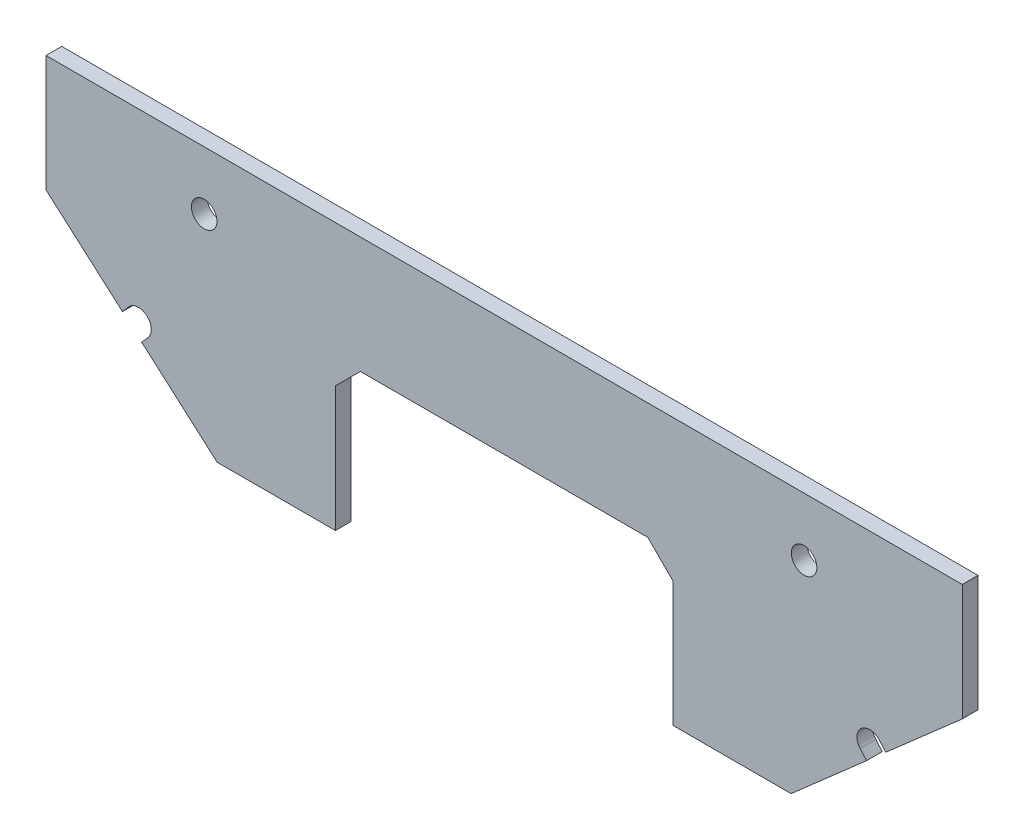
ISO-10303-21;
HEADER;
FILE_DESCRIPTION(('STEP AP214'),'2;1');
FILE_NAME('part.step','',(''),(''),'','','');
FILE_SCHEMA(('AUTOMOTIVE_DESIGN { 1 0 10303 214 1 1 1 1 }'));
ENDSEC;
DATA;
#1=APPLICATION_CONTEXT('core data for automotive mechanical design processes');
#2=APPLICATION_PROTOCOL_DEFINITION('international standard','automotive_design',2000,#1);
#3=PRODUCT_CONTEXT('',#1,'mechanical');
#4=PRODUCT('Part','Part','',(#3));
#5=PRODUCT_RELATED_PRODUCT_CATEGORY('part','',(#4));
#6=PRODUCT_DEFINITION_FORMATION('','',#4);
#7=PRODUCT_DEFINITION_CONTEXT('part definition',#1,'design');
#8=PRODUCT_DEFINITION('design','',#6,#7);
#9=PRODUCT_DEFINITION_SHAPE('','',#8);
#10=(LENGTH_UNIT() NAMED_UNIT(*) SI_UNIT(.MILLI.,.METRE.));
#11=(NAMED_UNIT(*) PLANE_ANGLE_UNIT() SI_UNIT($,.RADIAN.));
#12=(NAMED_UNIT(*) SI_UNIT($,.STERADIAN.) SOLID_ANGLE_UNIT());
#13=UNCERTAINTY_MEASURE_WITH_UNIT(LENGTH_MEASURE(1.E-05),#10,'distance_accuracy_value','');
#14=(GEOMETRIC_REPRESENTATION_CONTEXT(3) GLOBAL_UNCERTAINTY_ASSIGNED_CONTEXT((#13)) GLOBAL_UNIT_ASSIGNED_CONTEXT((#10,
#11,#12)) REPRESENTATION_CONTEXT('',''));
#15=CARTESIAN_POINT('',(0.,0.,0.));
#16=DIRECTION('',(0.,0.,1.));
#17=DIRECTION('',(1.,0.,0.));
#18=AXIS2_PLACEMENT_3D('',#15,#16,#17);
#19=CARTESIAN_POINT('',(-87.1981999509101,-5.91819995397121,3.23019999998737));
#20=DIRECTION('',(-0.659755740391198,-0.751480114853921,0.));
#21=DIRECTION('',(0.751480114853921,-0.659755740391198,0.));
#22=AXIS2_PLACEMENT_3D('',#19,#20,#21);
#23=PLANE('',#22);
#24=DIRECTION('',(0.,0.,-1.));
#25=VECTOR('',#24,1.);
#26=CARTESIAN_POINT('',(-77.473695427574,-14.4557481271232,3.23019999998742));
#27=LINE('',#26,#25);
#28=CARTESIAN_POINT('',(-77.473695427574,-14.4557481271232,3.23019999998742));
#29=VERTEX_POINT('',#28);
#30=CARTESIAN_POINT('',(-77.473695427574,-14.4557481271232,1.62999999998741));
#31=VERTEX_POINT('',#30);
#32=EDGE_CURVE('E272',#29,#31,#27,.T.);
#33=ORIENTED_EDGE('',*,*,#32,.T.);
#34=DIRECTION('',(-0.751480114853921,0.659755740391198,0.));
#35=VECTOR('',#34,1.);
#36=CARTESIAN_POINT('',(-87.1981999509101,-5.91819995397121,1.62999999998739));
#37=LINE('',#36,#35);
#38=CARTESIAN_POINT('',(-69.8038217829392,-21.1894501441175,1.62999999998742));
#39=VERTEX_POINT('',#38);
#40=EDGE_CURVE('E251',#39,#31,#37,.T.);
#41=ORIENTED_EDGE('',*,*,#40,.F.);
#42=DIRECTION('',(0.,0.,-1.));
#43=VECTOR('',#42,1.);
#44=CARTESIAN_POINT('',(-69.8038217829392,-21.1894501441175,3.23019999998744));
#45=LINE('',#44,#43);
#46=CARTESIAN_POINT('',(-69.8038217829392,-21.1894501441175,3.23019999998744));
#47=VERTEX_POINT('',#46);
#48=EDGE_CURVE('E389',#47,#39,#45,.T.);
#49=ORIENTED_EDGE('',*,*,#48,.F.);
#50=DIRECTION('',(-0.751480114853921,0.659755740391198,0.));
#51=VECTOR('',#50,1.);
#52=CARTESIAN_POINT('',(-87.1981999509101,-5.91819995397121,3.23019999998737));
#53=LINE('',#52,#51);
#54=EDGE_CURVE('E242',#47,#29,#53,.T.);
#55=ORIENTED_EDGE('',*,*,#54,.T.);
#56=EDGE_LOOP('',(#33,#41,#49,#55));
#57=FACE_BOUND('',#56,.T.);
#58=ADVANCED_FACE('F35',(#57),#23,.T.);
#59=CARTESIAN_POINT('',(5.91819995390032,-5.91819995397122,3.2301999999876));
#60=DIRECTION('',(0.659755740391198,-0.751480114853921,0.));
#61=DIRECTION('',(0.751480114853921,0.659755740391198,0.));
#62=AXIS2_PLACEMENT_3D('',#59,#60,#61);
#63=PLANE('',#62);
#64=DIRECTION('',(0.,0.,-1.));
#65=VECTOR('',#64,1.);
#66=CARTESIAN_POINT('',(-1.85245627081557,-12.7403832021061,3.23019999998759));
#67=LINE('',#66,#65);
#68=CARTESIAN_POINT('',(-1.85245627081557,-12.7403832021061,3.23019999998759));
#69=VERTEX_POINT('',#68);
#70=CARTESIAN_POINT('',(-1.85245627081557,-12.7403832021061,1.62999999998759));
#71=VERTEX_POINT('',#70);
#72=EDGE_CURVE('E169',#69,#71,#67,.T.);
#73=ORIENTED_EDGE('',*,*,#72,.T.);
#74=DIRECTION('',(-0.751480114853921,-0.659755740391198,0.));
#75=VECTOR('',#74,1.);
#76=CARTESIAN_POINT('',(5.91819995390032,-5.91819995397122,1.6299999999876));
#77=LINE('',#76,#75);
#78=CARTESIAN_POINT('',(5.91819995390032,-5.91819995397122,1.6299999999876));
#79=VERTEX_POINT('',#78);
#80=EDGE_CURVE('E210',#79,#71,#77,.T.);
#81=ORIENTED_EDGE('',*,*,#80,.F.);
#82=DIRECTION('',(0.,0.,-1.));
#83=VECTOR('',#82,1.);
#84=CARTESIAN_POINT('',(5.91819995390032,-5.91819995397121,3.2301999999876));
#85=LINE('',#84,#83);
#86=CARTESIAN_POINT('',(5.91819995390032,-5.91819995397121,3.2301999999876));
#87=VERTEX_POINT('',#86);
#88=EDGE_CURVE('E194',#87,#79,#85,.T.);
#89=ORIENTED_EDGE('',*,*,#88,.F.);
#90=DIRECTION('',(-0.751480114853921,-0.659755740391198,0.));
#91=VECTOR('',#90,1.);
#92=CARTESIAN_POINT('',(5.91819995390032,-5.91819995397122,3.2301999999876));
#93=LINE('',#92,#91);
#94=EDGE_CURVE('E186',#87,#69,#93,.T.);
#95=ORIENTED_EDGE('',*,*,#94,.T.);
#96=EDGE_LOOP('',(#73,#81,#89,#95));
#97=FACE_BOUND('',#96,.T.);
#98=ADVANCED_FACE('F192',(#97),#63,.T.);
#99=CARTESIAN_POINT('',(5.91819995390032,-5.91819995397121,3.2301999999876));
#100=DIRECTION('',(-1.,0.,0.));
#101=DIRECTION('',(0.,0.,1.));
#102=AXIS2_PLACEMENT_3D('',#99,#100,#101);
#103=PLANE('',#102);
#104=DIRECTION('',(0.,1.,0.));
#105=VECTOR('',#104,1.);
#106=CARTESIAN_POINT('',(5.91819995390032,-5.91819995397121,1.6299999999876));
#107=LINE('',#106,#105);
#108=CARTESIAN_POINT('',(5.91819995390032,5.91819995396554,1.6299999999876));
#109=VERTEX_POINT('',#108);
#110=EDGE_CURVE('E414',#79,#109,#107,.T.);
#111=ORIENTED_EDGE('',*,*,#110,.T.);
#112=DIRECTION('',(0.,0.,-1.));
#113=VECTOR('',#112,1.);
#114=CARTESIAN_POINT('',(5.91819995390032,5.91819995396554,3.23019999998761));
#115=LINE('',#114,#113);
#116=CARTESIAN_POINT('',(5.91819995390032,5.91819995396554,3.23019999998761));
#117=VERTEX_POINT('',#116);
#118=EDGE_CURVE('E343',#117,#109,#115,.T.);
#119=ORIENTED_EDGE('',*,*,#118,.F.);
#120=DIRECTION('',(0.,1.,0.));
#121=VECTOR('',#120,1.);
#122=CARTESIAN_POINT('',(5.91819995390032,-5.91819995397121,3.2301999999876));
#123=LINE('',#122,#121);
#124=EDGE_CURVE('E339',#87,#117,#123,.T.);
#125=ORIENTED_EDGE('',*,*,#124,.F.);
#126=ORIENTED_EDGE('',*,*,#88,.T.);
#127=EDGE_LOOP('',(#111,#119,#125,#126));
#128=FACE_BOUND('',#127,.T.);
#129=ADVANCED_FACE('F428',(#128),#103,.F.);
#130=CARTESIAN_POINT('',(5.91819995390032,5.91819995396554,3.23019999998761));
#131=DIRECTION('',(0.,-1.,0.));
#132=DIRECTION('',(1.,0.,0.));
#133=AXIS2_PLACEMENT_3D('',#130,#131,#132);
#134=PLANE('',#133);
#135=DIRECTION('',(-1.,0.,0.));
#136=VECTOR('',#135,1.);
#137=CARTESIAN_POINT('',(5.91819995390032,5.91819995396554,1.6299999999876));
#138=LINE('',#137,#136);
#139=CARTESIAN_POINT('',(-87.1981999509101,5.91819995396553,1.62999999998738));
#140=VERTEX_POINT('',#139);
#141=EDGE_CURVE('E413',#109,#140,#138,.T.);
#142=ORIENTED_EDGE('',*,*,#141,.T.);
#143=DIRECTION('',(0.,0.,-1.));
#144=VECTOR('',#143,1.);
#145=CARTESIAN_POINT('',(-87.1981999509101,5.91819995396553,3.23019999998739));
#146=LINE('',#145,#144);
#147=CARTESIAN_POINT('',(-87.1981999509101,5.91819995396553,3.23019999998739));
#148=VERTEX_POINT('',#147);
#149=EDGE_CURVE('E348',#148,#140,#146,.T.);
#150=ORIENTED_EDGE('',*,*,#149,.F.);
#151=DIRECTION('',(-1.,0.,0.));
#152=VECTOR('',#151,1.);
#153=CARTESIAN_POINT('',(5.91819995390032,5.91819995396554,3.23019999998761));
#154=LINE('',#153,#152);
#155=EDGE_CURVE('E424',#117,#148,#154,.T.);
#156=ORIENTED_EDGE('',*,*,#155,.F.);
#157=ORIENTED_EDGE('',*,*,#118,.T.);
#158=EDGE_LOOP('',(#142,#150,#156,#157));
#159=FACE_BOUND('',#158,.T.);
#160=ADVANCED_FACE('F429',(#159),#134,.F.);
#161=CARTESIAN_POINT('',(-87.1981999509101,-5.91819995397121,3.23019999998737));
#162=DIRECTION('',(1.,0.,0.));
#163=DIRECTION('',(0.,0.,-1.));
#164=AXIS2_PLACEMENT_3D('',#161,#162,#163);
#165=PLANE('',#164);
#166=DIRECTION('',(0.,-1.,0.));
#167=VECTOR('',#166,1.);
#168=CARTESIAN_POINT('',(-87.1981999509101,-5.91819995397121,1.62999999998739));
#169=LINE('',#168,#167);
#170=CARTESIAN_POINT('',(-87.1981999509101,-5.91819995397121,1.62999999998739));
#171=VERTEX_POINT('',#170);
#172=EDGE_CURVE('E340',#140,#171,#169,.T.);
#173=ORIENTED_EDGE('',*,*,#172,.T.);
#174=DIRECTION('',(0.,0.,-1.));
#175=VECTOR('',#174,1.);
#176=CARTESIAN_POINT('',(-87.1981999509101,-5.91819995397121,3.23019999998737));
#177=LINE('',#176,#175);
#178=CARTESIAN_POINT('',(-87.1981999509101,-5.91819995397121,3.23019999998737));
#179=VERTEX_POINT('',#178);
#180=EDGE_CURVE('E404',#179,#171,#177,.T.);
#181=ORIENTED_EDGE('',*,*,#180,.F.);
#182=DIRECTION('',(0.,-1.,0.));
#183=VECTOR('',#182,1.);
#184=CARTESIAN_POINT('',(-87.1981999509101,-5.91819995397121,3.23019999998737));
#185=LINE('',#184,#183);
#186=EDGE_CURVE('E380',#148,#179,#185,.T.);
#187=ORIENTED_EDGE('',*,*,#186,.F.);
#188=ORIENTED_EDGE('',*,*,#149,.T.);
#189=EDGE_LOOP('',(#173,#181,#187,#188));
#190=FACE_BOUND('',#189,.T.);
#191=ADVANCED_FACE('F411',(#190),#165,.F.);
#192=CARTESIAN_POINT('',(5.91819995390032,-5.91819995397121,3.2301999999876));
#193=DIRECTION('',(0.,1.,0.));
#194=DIRECTION('',(-1.,0.,0.));
#195=AXIS2_PLACEMENT_3D('',#192,#193,#194);
#196=PLANE('',#195);
#197=DIRECTION('',(1.,0.,0.));
#198=VECTOR('',#197,1.);
#199=CARTESIAN_POINT('',(5.91819995390032,-5.91819995397121,3.2301999999876));
#200=LINE('',#199,#198);
#201=CARTESIAN_POINT('',(-55.2450001556781,-5.91819995397122,3.23019999998745));
#202=VERTEX_POINT('',#201);
#203=CARTESIAN_POINT('',(-26.0349998413316,-5.91819995397121,3.23019999998752));
#204=VERTEX_POINT('',#203);
#205=EDGE_CURVE('E351',#202,#204,#200,.T.);
#206=ORIENTED_EDGE('',*,*,#205,.F.);
#207=DIRECTION('',(0.,0.,-1.));
#208=VECTOR('',#207,1.);
#209=CARTESIAN_POINT('',(-55.2450001556781,-5.91819995397122,3.23019999998745));
#210=LINE('',#209,#208);
#211=CARTESIAN_POINT('',(-55.2450001556781,-5.91819995397122,1.62999999998748));
#212=VERTEX_POINT('',#211);
#213=EDGE_CURVE('E338',#202,#212,#210,.T.);
#214=ORIENTED_EDGE('',*,*,#213,.T.);
#215=DIRECTION('',(1.,0.,0.));
#216=VECTOR('',#215,1.);
#217=CARTESIAN_POINT('',(5.91819995390032,-5.91819995397121,1.6299999999876));
#218=LINE('',#217,#216);
#219=CARTESIAN_POINT('',(-26.0349998413316,-5.91819995397096,1.62999999998752));
#220=VERTEX_POINT('',#219);
#221=EDGE_CURVE('E327',#212,#220,#218,.T.);
#222=ORIENTED_EDGE('',*,*,#221,.T.);
#223=DIRECTION('',(0.,0.,1.));
#224=VECTOR('',#223,1.);
#225=CARTESIAN_POINT('',(-26.0349998413316,-5.91819995397121,3.23019999998752));
#226=LINE('',#225,#224);
#227=EDGE_CURVE('E335',#220,#204,#226,.T.);
#228=ORIENTED_EDGE('',*,*,#227,.T.);
#229=EDGE_LOOP('',(#206,#214,#222,#228));
#230=FACE_BOUND('',#229,.T.);
#231=ADVANCED_FACE('F334',(#230),#196,.F.);
#232=CARTESIAN_POINT('',(0.,0.,3.23019999998759));
#233=DIRECTION('',(0.,0.,1.));
#234=DIRECTION('',(1.,0.,0.));
#235=AXIS2_PLACEMENT_3D('',#232,#233,#234);
#236=PLANE('',#235);
#237=DIRECTION('',(0.659755740391189,-0.751480114853929,0.));
#238=VECTOR('',#237,1.);
#239=CARTESIAN_POINT('',(-1.85245627081557,-12.7403832021061,3.23019999998759));
#240=LINE('',#239,#238);
#241=CARTESIAN_POINT('',(-2.50475861895037,-11.9973926391945,3.23019999998759));
#242=VERTEX_POINT('',#241);
#243=EDGE_CURVE('E58',#242,#69,#240,.T.);
#244=ORIENTED_EDGE('',*,*,#243,.T.);
#245=ORIENTED_EDGE('',*,*,#94,.F.);
#246=ORIENTED_EDGE('',*,*,#124,.T.);
#247=ORIENTED_EDGE('',*,*,#155,.T.);
#248=ORIENTED_EDGE('',*,*,#186,.T.);
#249=CARTESIAN_POINT('',(-79.4275437261942,-12.7403832021061,3.23019999998738));
#250=VERTEX_POINT('',#249);
#251=EDGE_CURVE('E240',#250,#179,#53,.T.);
#252=ORIENTED_EDGE('',*,*,#251,.F.);
#253=DIRECTION('',(0.659755740391197,0.751480114853921,0.));
#254=VECTOR('',#253,1.);
#255=CARTESIAN_POINT('',(-79.4275437261942,-12.7403832021061,3.23019999998738));
#256=LINE('',#255,#254);
#257=CARTESIAN_POINT('',(-78.7752413439108,-11.9973926691744,3.23019999998738));
#258=VERTEX_POINT('',#257);
#259=EDGE_CURVE('E268',#250,#258,#256,.T.);
#260=ORIENTED_EDGE('',*,*,#259,.T.);
#261=CARTESIAN_POINT('',(-77.7983171946007,-12.8550751316826,3.23019999998738));
#262=DIRECTION('',(0.,0.,1.));
#263=DIRECTION('',(1.,0.,0.));
#264=AXIS2_PLACEMENT_3D('',#261,#262,#263);
#265=CIRCLE('',#264,1.3);
#266=CARTESIAN_POINT('',(-76.8213930452906,-13.7127575941918,3.23019999998738));
#267=VERTEX_POINT('',#266);
#268=EDGE_CURVE('E297',#267,#258,#265,.T.);
#269=ORIENTED_EDGE('',*,*,#268,.F.);
#270=DIRECTION('',(-0.659755740391198,-0.751480114853921,0.));
#271=VECTOR('',#270,1.);
#272=CARTESIAN_POINT('',(-76.8213930452906,-13.7127575941918,3.23019999998738));
#273=LINE('',#272,#271);
#274=EDGE_CURVE('E283',#267,#29,#273,.T.);
#275=ORIENTED_EDGE('',*,*,#274,.T.);
#276=ORIENTED_EDGE('',*,*,#54,.F.);
#277=DIRECTION('',(-1.,0.,0.));
#278=VECTOR('',#277,1.);
#279=CARTESIAN_POINT('',(-69.8038217829392,-21.1894501441175,3.23019999998744));
#280=LINE('',#279,#278);
#281=CARTESIAN_POINT('',(-57.7850001556781,-21.1894501441175,3.23019999998744));
#282=VERTEX_POINT('',#281);
#283=EDGE_CURVE('E237',#282,#47,#280,.T.);
#284=ORIENTED_EDGE('',*,*,#283,.F.);
#285=DIRECTION('',(0.,-1.,0.));
#286=VECTOR('',#285,1.);
#287=CARTESIAN_POINT('',(-57.7850001556781,-21.1894501441175,3.23019999998744));
#288=LINE('',#287,#286);
#289=CARTESIAN_POINT('',(-57.7850001556781,-8.45819995397122,3.23019999998746));
#290=VERTEX_POINT('',#289);
#291=EDGE_CURVE('E241',#290,#282,#288,.T.);
#292=ORIENTED_EDGE('',*,*,#291,.F.);
#293=DIRECTION('',(0.70710678118655,0.707106781186545,0.));
#294=VECTOR('',#293,1.);
#295=CARTESIAN_POINT('',(-55.2450001556781,-5.91819995397122,3.23019999998745));
#296=LINE('',#295,#294);
#297=EDGE_CURVE('E330',#290,#202,#296,.T.);
#298=ORIENTED_EDGE('',*,*,#297,.T.);
#299=ORIENTED_EDGE('',*,*,#205,.T.);
#300=DIRECTION('',(0.707106781186544,-0.707106781186551,0.));
#301=VECTOR('',#300,1.);
#302=CARTESIAN_POINT('',(-23.4949998413316,-8.45819995397125,3.23019999998756));
#303=LINE('',#302,#301);
#304=CARTESIAN_POINT('',(-23.4949998413316,-8.45819995397125,3.23019999998756));
#305=VERTEX_POINT('',#304);
#306=EDGE_CURVE('E12',#204,#305,#303,.T.);
#307=ORIENTED_EDGE('',*,*,#306,.T.);
#308=DIRECTION('',(0.,1.,0.));
#309=VECTOR('',#308,1.);
#310=CARTESIAN_POINT('',(-23.4949998413315,-21.1894501441175,3.23019999998752));
#311=LINE('',#310,#309);
#312=CARTESIAN_POINT('',(-23.4949998413315,-21.1894501441175,3.23019999998752));
#313=VERTEX_POINT('',#312);
#314=EDGE_CURVE('E199',#313,#305,#311,.T.);
#315=ORIENTED_EDGE('',*,*,#314,.F.);
#316=DIRECTION('',(-1.,0.,0.));
#317=VECTOR('',#316,1.);
#318=CARTESIAN_POINT('',(-11.4761782140705,-21.1894501441175,3.23019999998753));
#319=LINE('',#318,#317);
#320=CARTESIAN_POINT('',(-11.4761782140705,-21.1894501441175,3.23019999998753));
#321=VERTEX_POINT('',#320);
#322=EDGE_CURVE('E195',#321,#313,#319,.T.);
#323=ORIENTED_EDGE('',*,*,#322,.F.);
#324=CARTESIAN_POINT('',(-3.80630456943576,-14.4557481271226,3.23019999998759));
#325=VERTEX_POINT('',#324);
#326=EDGE_CURVE('E196',#325,#321,#93,.T.);
#327=ORIENTED_EDGE('',*,*,#326,.F.);
#328=DIRECTION('',(-0.659755740391198,0.751480114853921,0.));
#329=VECTOR('',#328,1.);
#330=CARTESIAN_POINT('',(-4.45860695171893,-13.7127575941916,3.23019999998759));
#331=LINE('',#330,#329);
#332=CARTESIAN_POINT('',(-4.45860695171893,-13.7127575941916,3.23019999998759));
#333=VERTEX_POINT('',#332);
#334=EDGE_CURVE('E178',#325,#333,#331,.T.);
#335=ORIENTED_EDGE('',*,*,#334,.T.);
#336=CARTESIAN_POINT('',(-3.48168274193975,-12.8550751316833,3.23019999998759));
#337=DIRECTION('',(0.,0.,1.));
#338=DIRECTION('',(1.,0.,0.));
#339=AXIS2_PLACEMENT_3D('',#336,#337,#338);
#340=CIRCLE('',#339,1.3);
#341=EDGE_CURVE('E189',#242,#333,#340,.T.);
#342=ORIENTED_EDGE('',*,*,#341,.F.);
#343=EDGE_LOOP('',(#244,#245,#246,#247,#248,#252,#260,#269,#275,#276,#284,#292,#298,#299,#307,
#315,#323,#327,#335,#342));
#344=FACE_BOUND('',#343,.T.);
#345=CARTESIAN_POINT('',(-10.1600000918155,-7.59865087518463E-08,3.23019999998757));
#346=DIRECTION('',(0.,0.,1.));
#347=DIRECTION('',(1.,0.,0.));
#348=AXIS2_PLACEMENT_3D('',#345,#346,#347);
#349=CIRCLE('',#348,1.3);
#350=CARTESIAN_POINT('',(-8.86000009181546,-7.59865087518463E-08,3.23019999998758));
#351=VERTEX_POINT('',#350);
#352=EDGE_CURVE('E275',#351,#351,#349,.T.);
#353=ORIENTED_EDGE('',*,*,#352,.F.);
#354=EDGE_LOOP('',(#353));
#355=FACE_BOUND('',#354,.T.);
#356=CARTESIAN_POINT('',(-71.1199998115936,-3.45394615686168E-08,3.23019999998742));
#357=DIRECTION('',(0.,0.,1.));
#358=DIRECTION('',(1.,0.,0.));
#359=AXIS2_PLACEMENT_3D('',#356,#357,#358);
#360=CIRCLE('',#359,1.3);
#361=CARTESIAN_POINT('',(-69.8199998115936,-3.45394615686168E-08,3.23019999998742));
#362=VERTEX_POINT('',#361);
#363=EDGE_CURVE('E290',#362,#362,#360,.T.);
#364=ORIENTED_EDGE('',*,*,#363,.F.);
#365=EDGE_LOOP('',(#364));
#366=FACE_BOUND('',#365,.T.);
#367=ADVANCED_FACE('F183',(#344,#355,#366),#236,.T.);
#368=CARTESIAN_POINT('',(0.,0.,1.62999999998759));
#369=DIRECTION('',(0.,0.,1.));
#370=DIRECTION('',(1.,0.,0.));
#371=AXIS2_PLACEMENT_3D('',#368,#369,#370);
#372=PLANE('',#371);
#373=CARTESIAN_POINT('',(-10.1600000918155,-7.59865087518463E-08,1.62999999998756));
#374=DIRECTION('',(0.,0.,1.));
#375=DIRECTION('',(1.,0.,0.));
#376=AXIS2_PLACEMENT_3D('',#373,#374,#375);
#377=CIRCLE('',#376,1.3);
#378=CARTESIAN_POINT('',(-8.86000009181546,-7.59865087518463E-08,1.62999999998757));
#379=VERTEX_POINT('',#378);
#380=EDGE_CURVE('E286',#379,#379,#377,.T.);
#381=ORIENTED_EDGE('',*,*,#380,.T.);
#382=EDGE_LOOP('',(#381));
#383=FACE_BOUND('',#382,.T.);
#384=CARTESIAN_POINT('',(-71.1199998115936,-3.45394615686168E-08,1.62999999998741));
#385=DIRECTION('',(0.,0.,1.));
#386=DIRECTION('',(1.,0.,0.));
#387=AXIS2_PLACEMENT_3D('',#384,#385,#386);
#388=CIRCLE('',#387,1.3);
#389=CARTESIAN_POINT('',(-69.8199998115936,-3.45394615686168E-08,1.62999999998741));
#390=VERTEX_POINT('',#389);
#391=EDGE_CURVE('E293',#390,#390,#388,.T.);
#392=ORIENTED_EDGE('',*,*,#391,.T.);
#393=EDGE_LOOP('',(#392));
#394=FACE_BOUND('',#393,.T.);
#395=ORIENTED_EDGE('',*,*,#80,.T.);
#396=DIRECTION('',(0.659755740391189,-0.751480114853929,0.));
#397=VECTOR('',#396,1.);
#398=CARTESIAN_POINT('',(-1.85245627081557,-12.7403832021061,1.62999999998759));
#399=LINE('',#398,#397);
#400=CARTESIAN_POINT('',(-2.50475865309872,-11.9973926691747,1.62999999998757));
#401=VERTEX_POINT('',#400);
#402=EDGE_CURVE('E172',#401,#71,#399,.T.);
#403=ORIENTED_EDGE('',*,*,#402,.F.);
#404=CARTESIAN_POINT('',(-3.48168274193975,-12.8550751316833,1.62999999998757));
#405=DIRECTION('',(0.,0.,1.));
#406=DIRECTION('',(1.,0.,0.));
#407=AXIS2_PLACEMENT_3D('',#404,#405,#406);
#408=CIRCLE('',#407,1.3);
#409=CARTESIAN_POINT('',(-4.45860689124965,-13.7127575941916,1.62999999998759));
#410=VERTEX_POINT('',#409);
#411=EDGE_CURVE('E203',#401,#410,#408,.T.);
#412=ORIENTED_EDGE('',*,*,#411,.T.);
#413=DIRECTION('',(-0.659755740391198,0.751480114853921,0.));
#414=VECTOR('',#413,1.);
#415=CARTESIAN_POINT('',(-4.45860695171893,-13.7127575941916,1.62999999998759));
#416=LINE('',#415,#414);
#417=CARTESIAN_POINT('',(-3.80630456943576,-14.4557481271226,1.62999999998759));
#418=VERTEX_POINT('',#417);
#419=EDGE_CURVE('E50',#418,#410,#416,.T.);
#420=ORIENTED_EDGE('',*,*,#419,.F.);
#421=CARTESIAN_POINT('',(-11.4761782140705,-21.1894501441175,1.62999999998757));
#422=VERTEX_POINT('',#421);
#423=EDGE_CURVE('E214',#418,#422,#77,.T.);
#424=ORIENTED_EDGE('',*,*,#423,.T.);
#425=DIRECTION('',(-1.,0.,0.));
#426=VECTOR('',#425,1.);
#427=CARTESIAN_POINT('',(-11.4761782140705,-21.1894501441175,1.62999999998757));
#428=LINE('',#427,#426);
#429=CARTESIAN_POINT('',(-23.4949998413315,-21.1894501441175,1.62999999998753));
#430=VERTEX_POINT('',#429);
#431=EDGE_CURVE('E213',#422,#430,#428,.T.);
#432=ORIENTED_EDGE('',*,*,#431,.T.);
#433=DIRECTION('',(0.,1.,0.));
#434=VECTOR('',#433,1.);
#435=CARTESIAN_POINT('',(-23.4949998413315,-21.1894501441175,1.62999999998753));
#436=LINE('',#435,#434);
#437=CARTESIAN_POINT('',(-23.4949998413316,-8.45819995397125,1.62999999998752));
#438=VERTEX_POINT('',#437);
#439=EDGE_CURVE('E201',#430,#438,#436,.T.);
#440=ORIENTED_EDGE('',*,*,#439,.T.);
#441=DIRECTION('',(-0.707106781186544,0.707106781186551,0.));
#442=VECTOR('',#441,1.);
#443=CARTESIAN_POINT('',(-15.9765998976515,-15.9765998976514,1.62999999998753));
#444=LINE('',#443,#442);
#445=EDGE_CURVE('E43',#438,#220,#444,.T.);
#446=ORIENTED_EDGE('',*,*,#445,.T.);
#447=ORIENTED_EDGE('',*,*,#221,.F.);
#448=DIRECTION('',(-0.70710678118655,-0.707106781186545,0.));
#449=VECTOR('',#448,1.);
#450=CARTESIAN_POINT('',(-24.6634001008532,24.6634001008536,1.62999999998755));
#451=LINE('',#450,#449);
#452=CARTESIAN_POINT('',(-57.7850001556781,-8.45819995397122,1.62999999998745));
#453=VERTEX_POINT('',#452);
#454=EDGE_CURVE('E370',#212,#453,#451,.T.);
#455=ORIENTED_EDGE('',*,*,#454,.T.);
#456=DIRECTION('',(0.,-1.,0.));
#457=VECTOR('',#456,1.);
#458=CARTESIAN_POINT('',(-57.7850001556781,-21.1894501441175,1.62999999998745));
#459=LINE('',#458,#457);
#460=CARTESIAN_POINT('',(-57.7850001556781,-21.1894501441175,1.62999999998745));
#461=VERTEX_POINT('',#460);
#462=EDGE_CURVE('E234',#453,#461,#459,.T.);
#463=ORIENTED_EDGE('',*,*,#462,.T.);
#464=DIRECTION('',(-1.,0.,0.));
#465=VECTOR('',#464,1.);
#466=CARTESIAN_POINT('',(-69.8038217829392,-21.1894501441175,1.62999999998742));
#467=LINE('',#466,#465);
#468=EDGE_CURVE('E246',#461,#39,#467,.T.);
#469=ORIENTED_EDGE('',*,*,#468,.T.);
#470=ORIENTED_EDGE('',*,*,#40,.T.);
#471=DIRECTION('',(-0.659755740391198,-0.751480114853921,0.));
#472=VECTOR('',#471,1.);
#473=CARTESIAN_POINT('',(-76.8213930452906,-13.7127575941918,1.6299999999874));
#474=LINE('',#473,#472);
#475=CARTESIAN_POINT('',(-76.8213930452906,-13.7127575941918,1.6299999999874));
#476=VERTEX_POINT('',#475);
#477=EDGE_CURVE('E264',#476,#31,#474,.T.);
#478=ORIENTED_EDGE('',*,*,#477,.F.);
#479=CARTESIAN_POINT('',(-77.7983171946007,-12.8550751316826,1.6299999999874));
#480=DIRECTION('',(0.,0.,1.));
#481=DIRECTION('',(1.,0.,0.));
#482=AXIS2_PLACEMENT_3D('',#479,#480,#481);
#483=CIRCLE('',#482,1.3);
#484=CARTESIAN_POINT('',(-78.7752413439108,-11.9973926691744,1.62999999998738));
#485=VERTEX_POINT('',#484);
#486=EDGE_CURVE('E299',#476,#485,#483,.T.);
#487=ORIENTED_EDGE('',*,*,#486,.T.);
#488=DIRECTION('',(0.659755740391197,0.751480114853921,0.));
#489=VECTOR('',#488,1.);
#490=CARTESIAN_POINT('',(-79.4275437261942,-12.7403832021061,1.6299999999874));
#491=LINE('',#490,#489);
#492=CARTESIAN_POINT('',(-79.4275437261942,-12.7403832021061,1.6299999999874));
#493=VERTEX_POINT('',#492);
#494=EDGE_CURVE('E269',#493,#485,#491,.T.);
#495=ORIENTED_EDGE('',*,*,#494,.F.);
#496=EDGE_CURVE('E250',#493,#171,#37,.T.);
#497=ORIENTED_EDGE('',*,*,#496,.T.);
#498=ORIENTED_EDGE('',*,*,#172,.F.);
#499=ORIENTED_EDGE('',*,*,#141,.F.);
#500=ORIENTED_EDGE('',*,*,#110,.F.);
#501=EDGE_LOOP('',(#395,#403,#412,#420,#424,#432,#440,#446,#447,#455,#463,#469,#470,#478,#487,
#495,#497,#498,#499,#500));
#502=FACE_BOUND('',#501,.T.);
#503=ADVANCED_FACE('F308',(#383,#394,#502),#372,.F.);
#504=DIRECTION('',(0.,0.,-1.));
#505=VECTOR('',#504,1.);
#506=CARTESIAN_POINT('',(-79.4275437261942,-12.7403832021061,3.23019999998738));
#507=LINE('',#506,#505);
#508=EDGE_CURVE('E281',#250,#493,#507,.T.);
#509=ORIENTED_EDGE('',*,*,#508,.F.);
#510=ORIENTED_EDGE('',*,*,#251,.T.);
#511=ORIENTED_EDGE('',*,*,#180,.T.);
#512=ORIENTED_EDGE('',*,*,#496,.F.);
#513=EDGE_LOOP('',(#509,#510,#511,#512));
#514=FACE_BOUND('',#513,.T.);
#515=ADVANCED_FACE('F405',(#514),#23,.T.);
#516=CARTESIAN_POINT('',(-69.8038217829392,-21.1894501441175,3.23019999998744));
#517=DIRECTION('',(0.,-1.,0.));
#518=DIRECTION('',(0.,0.,-1.));
#519=AXIS2_PLACEMENT_3D('',#516,#517,#518);
#520=PLANE('',#519);
#521=ORIENTED_EDGE('',*,*,#468,.F.);
#522=DIRECTION('',(0.,0.,-1.));
#523=VECTOR('',#522,1.);
#524=CARTESIAN_POINT('',(-57.7850001556781,-21.1894501441175,3.23019999998744));
#525=LINE('',#524,#523);
#526=EDGE_CURVE('E245',#282,#461,#525,.T.);
#527=ORIENTED_EDGE('',*,*,#526,.F.);
#528=ORIENTED_EDGE('',*,*,#283,.T.);
#529=ORIENTED_EDGE('',*,*,#48,.T.);
#530=EDGE_LOOP('',(#521,#527,#528,#529));
#531=FACE_BOUND('',#530,.T.);
#532=ADVANCED_FACE('F391',(#531),#520,.T.);
#533=CARTESIAN_POINT('',(-57.7850001556781,-21.1894501441175,3.23019999998744));
#534=DIRECTION('',(1.,0.,0.));
#535=DIRECTION('',(0.,0.,-1.));
#536=AXIS2_PLACEMENT_3D('',#533,#534,#535);
#537=PLANE('',#536);
#538=ORIENTED_EDGE('',*,*,#462,.F.);
#539=DIRECTION('',(0.,0.,1.));
#540=VECTOR('',#539,1.);
#541=CARTESIAN_POINT('',(-57.7850001556781,-8.45819995397122,3.23019999998746));
#542=LINE('',#541,#540);
#543=EDGE_CURVE('E345',#453,#290,#542,.T.);
#544=ORIENTED_EDGE('',*,*,#543,.T.);
#545=ORIENTED_EDGE('',*,*,#291,.T.);
#546=ORIENTED_EDGE('',*,*,#526,.T.);
#547=EDGE_LOOP('',(#538,#544,#545,#546));
#548=FACE_BOUND('',#547,.T.);
#549=ADVANCED_FACE('F385',(#548),#537,.T.);
#550=DIRECTION('',(0.,0.,-1.));
#551=VECTOR('',#550,1.);
#552=CARTESIAN_POINT('',(-3.80630456943576,-14.4557481271226,3.23019999998759));
#553=LINE('',#552,#551);
#554=EDGE_CURVE('E177',#325,#418,#553,.T.);
#555=ORIENTED_EDGE('',*,*,#554,.F.);
#556=ORIENTED_EDGE('',*,*,#326,.T.);
#557=DIRECTION('',(0.,0.,-1.));
#558=VECTOR('',#557,1.);
#559=CARTESIAN_POINT('',(-11.4761782140705,-21.1894501441175,3.23019999998753));
#560=LINE('',#559,#558);
#561=EDGE_CURVE('E209',#321,#422,#560,.T.);
#562=ORIENTED_EDGE('',*,*,#561,.T.);
#563=ORIENTED_EDGE('',*,*,#423,.F.);
#564=EDGE_LOOP('',(#555,#556,#562,#563));
#565=FACE_BOUND('',#564,.T.);
#566=ADVANCED_FACE('F313',(#565),#63,.T.);
#567=CARTESIAN_POINT('',(-23.4949998413315,-21.1894501441175,3.23019999998752));
#568=DIRECTION('',(-1.,0.,0.));
#569=DIRECTION('',(0.,0.,1.));
#570=AXIS2_PLACEMENT_3D('',#567,#568,#569);
#571=PLANE('',#570);
#572=ORIENTED_EDGE('',*,*,#314,.T.);
#573=DIRECTION('',(0.,0.,-1.));
#574=VECTOR('',#573,1.);
#575=CARTESIAN_POINT('',(-23.4949998413316,-8.45819995397125,3.23019999998756));
#576=LINE('',#575,#574);
#577=EDGE_CURVE('E324',#305,#438,#576,.T.);
#578=ORIENTED_EDGE('',*,*,#577,.T.);
#579=ORIENTED_EDGE('',*,*,#439,.F.);
#580=DIRECTION('',(0.,0.,-1.));
#581=VECTOR('',#580,1.);
#582=CARTESIAN_POINT('',(-23.4949998413315,-21.1894501441175,3.23019999998752));
#583=LINE('',#582,#581);
#584=EDGE_CURVE('E232',#313,#430,#583,.T.);
#585=ORIENTED_EDGE('',*,*,#584,.F.);
#586=EDGE_LOOP('',(#572,#578,#579,#585));
#587=FACE_BOUND('',#586,.T.);
#588=ADVANCED_FACE('F322',(#587),#571,.T.);
#589=CARTESIAN_POINT('',(-11.4761782140705,-21.1894501441175,3.23019999998753));
#590=DIRECTION('',(0.,-1.,0.));
#591=DIRECTION('',(0.,0.,-1.));
#592=AXIS2_PLACEMENT_3D('',#589,#590,#591);
#593=PLANE('',#592);
#594=ORIENTED_EDGE('',*,*,#431,.F.);
#595=ORIENTED_EDGE('',*,*,#561,.F.);
#596=ORIENTED_EDGE('',*,*,#322,.T.);
#597=ORIENTED_EDGE('',*,*,#584,.T.);
#598=EDGE_LOOP('',(#594,#595,#596,#597));
#599=FACE_BOUND('',#598,.T.);
#600=ADVANCED_FACE('F317',(#599),#593,.T.);
#601=CARTESIAN_POINT('',(-55.2450001556781,-5.91819995397122,3.23019999998745));
#602=DIRECTION('',(-0.707106781186545,0.70710678118655,0.));
#603=DIRECTION('',(0.,0.,-1.));
#604=AXIS2_PLACEMENT_3D('',#601,#602,#603);
#605=PLANE('',#604);
#606=ORIENTED_EDGE('',*,*,#297,.F.);
#607=ORIENTED_EDGE('',*,*,#543,.F.);
#608=ORIENTED_EDGE('',*,*,#454,.F.);
#609=ORIENTED_EDGE('',*,*,#213,.F.);
#610=EDGE_LOOP('',(#606,#607,#608,#609));
#611=FACE_BOUND('',#610,.T.);
#612=ADVANCED_FACE('F381',(#611),#605,.F.);
#613=CARTESIAN_POINT('',(-23.4949998413316,-8.45819995397125,3.23019999998756));
#614=DIRECTION('',(0.707106781186551,0.707106781186544,0.));
#615=DIRECTION('',(0.,0.,-1.));
#616=AXIS2_PLACEMENT_3D('',#613,#614,#615);
#617=PLANE('',#616);
#618=ORIENTED_EDGE('',*,*,#306,.F.);
#619=ORIENTED_EDGE('',*,*,#227,.F.);
#620=ORIENTED_EDGE('',*,*,#445,.F.);
#621=ORIENTED_EDGE('',*,*,#577,.F.);
#622=EDGE_LOOP('',(#618,#619,#620,#621));
#623=FACE_BOUND('',#622,.T.);
#624=ADVANCED_FACE('F37',(#623),#617,.F.);
#625=CARTESIAN_POINT('',(-3.48168274193975,-12.8550751316833,3.23019999998759));
#626=DIRECTION('',(0.,0.,1.));
#627=DIRECTION('',(1.,0.,0.));
#628=AXIS2_PLACEMENT_3D('',#625,#626,#627);
#629=CYLINDRICAL_SURFACE('',#628,1.3);
#630=ORIENTED_EDGE('',*,*,#411,.F.);
#631=DIRECTION('',(0.,0.,-1.));
#632=VECTOR('',#631,1.);
#633=CARTESIAN_POINT('',(-2.50475865309872,-11.9973926691747,3.23019999998759));
#634=LINE('',#633,#632);
#635=EDGE_CURVE('E446',#242,#401,#634,.T.);
#636=ORIENTED_EDGE('',*,*,#635,.F.);
#637=ORIENTED_EDGE('',*,*,#341,.T.);
#638=DIRECTION('',(0.,0.,-1.));
#639=VECTOR('',#638,1.);
#640=CARTESIAN_POINT('',(-4.45860695171893,-13.7127575941916,3.23019999998759));
#641=LINE('',#640,#639);
#642=EDGE_CURVE('E444',#333,#410,#641,.T.);
#643=ORIENTED_EDGE('',*,*,#642,.T.);
#644=EDGE_LOOP('',(#630,#636,#637,#643));
#645=FACE_BOUND('',#644,.T.);
#646=ADVANCED_FACE('F452',(#645),#629,.F.);
#647=CARTESIAN_POINT('',(-77.7983171946007,-12.8550751316826,3.23019999998738));
#648=DIRECTION('',(0.,0.,1.));
#649=DIRECTION('',(1.,0.,0.));
#650=AXIS2_PLACEMENT_3D('',#647,#648,#649);
#651=CYLINDRICAL_SURFACE('',#650,1.3);
#652=ORIENTED_EDGE('',*,*,#486,.F.);
#653=DIRECTION('',(0.,0.,-1.));
#654=VECTOR('',#653,1.);
#655=CARTESIAN_POINT('',(-76.8213930452906,-13.7127575941918,3.23019999998738));
#656=LINE('',#655,#654);
#657=EDGE_CURVE('E276',#267,#476,#656,.T.);
#658=ORIENTED_EDGE('',*,*,#657,.F.);
#659=ORIENTED_EDGE('',*,*,#268,.T.);
#660=DIRECTION('',(0.,0.,-1.));
#661=VECTOR('',#660,1.);
#662=CARTESIAN_POINT('',(-78.7752413439108,-11.9973926691744,3.23019999998738));
#663=LINE('',#662,#661);
#664=EDGE_CURVE('E278',#258,#485,#663,.T.);
#665=ORIENTED_EDGE('',*,*,#664,.T.);
#666=EDGE_LOOP('',(#652,#658,#659,#665));
#667=FACE_BOUND('',#666,.T.);
#668=ADVANCED_FACE('F438',(#667),#651,.F.);
#669=CARTESIAN_POINT('',(-71.1199998115936,-3.45394615686168E-08,3.23019999998742));
#670=DIRECTION('',(0.,0.,1.));
#671=DIRECTION('',(1.,0.,0.));
#672=AXIS2_PLACEMENT_3D('',#669,#670,#671);
#673=CYLINDRICAL_SURFACE('',#672,1.3);
#674=ORIENTED_EDGE('',*,*,#391,.F.);
#675=EDGE_LOOP('',(#674));
#676=FACE_BOUND('',#675,.T.);
#677=ORIENTED_EDGE('',*,*,#363,.T.);
#678=EDGE_LOOP('',(#677));
#679=FACE_BOUND('',#678,.T.);
#680=ADVANCED_FACE('F459',(#676,#679),#673,.F.);
#681=CARTESIAN_POINT('',(-10.1600000918155,-7.59865087518463E-08,3.23019999998757));
#682=DIRECTION('',(0.,0.,1.));
#683=DIRECTION('',(1.,0.,0.));
#684=AXIS2_PLACEMENT_3D('',#681,#682,#683);
#685=CYLINDRICAL_SURFACE('',#684,1.3);
#686=ORIENTED_EDGE('',*,*,#380,.F.);
#687=EDGE_LOOP('',(#686));
#688=FACE_BOUND('',#687,.T.);
#689=ORIENTED_EDGE('',*,*,#352,.T.);
#690=EDGE_LOOP('',(#689));
#691=FACE_BOUND('',#690,.T.);
#692=ADVANCED_FACE('F580',(#688,#691),#685,.F.);
#693=CARTESIAN_POINT('',(-79.4275437261942,-12.7403832021061,3.23019999998738));
#694=DIRECTION('',(-0.751480114853921,0.659755740391198,0.));
#695=DIRECTION('',(-0.659755740391198,-0.751480114853921,0.));
#696=AXIS2_PLACEMENT_3D('',#693,#694,#695);
#697=PLANE('',#696);
#698=ORIENTED_EDGE('',*,*,#494,.T.);
#699=ORIENTED_EDGE('',*,*,#664,.F.);
#700=ORIENTED_EDGE('',*,*,#259,.F.);
#701=ORIENTED_EDGE('',*,*,#508,.T.);
#702=EDGE_LOOP('',(#698,#699,#700,#701));
#703=FACE_BOUND('',#702,.T.);
#704=ADVANCED_FACE('F589',(#703),#697,.F.);
#705=CARTESIAN_POINT('',(-76.8213930452906,-13.7127575941918,3.23019999998738));
#706=DIRECTION('',(0.751480114853921,-0.659755740391198,0.));
#707=DIRECTION('',(0.659755740391198,0.751480114853921,0.));
#708=AXIS2_PLACEMENT_3D('',#705,#706,#707);
#709=PLANE('',#708);
#710=ORIENTED_EDGE('',*,*,#477,.T.);
#711=ORIENTED_EDGE('',*,*,#32,.F.);
#712=ORIENTED_EDGE('',*,*,#274,.F.);
#713=ORIENTED_EDGE('',*,*,#657,.T.);
#714=EDGE_LOOP('',(#710,#711,#712,#713));
#715=FACE_BOUND('',#714,.T.);
#716=ADVANCED_FACE('F440',(#715),#709,.F.);
#717=CARTESIAN_POINT('',(-4.45860695171893,-13.7127575941916,3.23019999998759));
#718=DIRECTION('',(-0.751480114853921,-0.659755740391198,0.));
#719=DIRECTION('',(0.659755740391198,-0.751480114853921,0.));
#720=AXIS2_PLACEMENT_3D('',#717,#718,#719);
#721=PLANE('',#720);
#722=ORIENTED_EDGE('',*,*,#419,.T.);
#723=ORIENTED_EDGE('',*,*,#642,.F.);
#724=ORIENTED_EDGE('',*,*,#334,.F.);
#725=ORIENTED_EDGE('',*,*,#554,.T.);
#726=EDGE_LOOP('',(#722,#723,#724,#725));
#727=FACE_BOUND('',#726,.T.);
#728=ADVANCED_FACE('F451',(#727),#721,.F.);
#729=CARTESIAN_POINT('',(-1.85245627081557,-12.7403832021061,3.23019999998759));
#730=DIRECTION('',(0.751480114853929,0.659755740391189,0.));
#731=DIRECTION('',(-0.659755740391189,0.751480114853929,0.));
#732=AXIS2_PLACEMENT_3D('',#729,#730,#731);
#733=PLANE('',#732);
#734=ORIENTED_EDGE('',*,*,#402,.T.);
#735=ORIENTED_EDGE('',*,*,#72,.F.);
#736=ORIENTED_EDGE('',*,*,#243,.F.);
#737=ORIENTED_EDGE('',*,*,#635,.T.);
#738=EDGE_LOOP('',(#734,#735,#736,#737));
#739=FACE_BOUND('',#738,.T.);
#740=ADVANCED_FACE('F170',(#739),#733,.F.);
#741=CLOSED_SHELL('',(#58,#98,#129,#160,#191,#231,#367,#503,#515,#532,#549,#566,#588,#600,#612,
#624,#646,#668,#680,#692,#704,#716,#728,#740));
#742=MANIFOLD_SOLID_BREP('B2',#741);
#743=ADVANCED_BREP_SHAPE_REPRESENTATION('',(#18,#742),#14);
#744=SHAPE_DEFINITION_REPRESENTATION(#9,#743);
ENDSEC;
END-ISO-10303-21;
